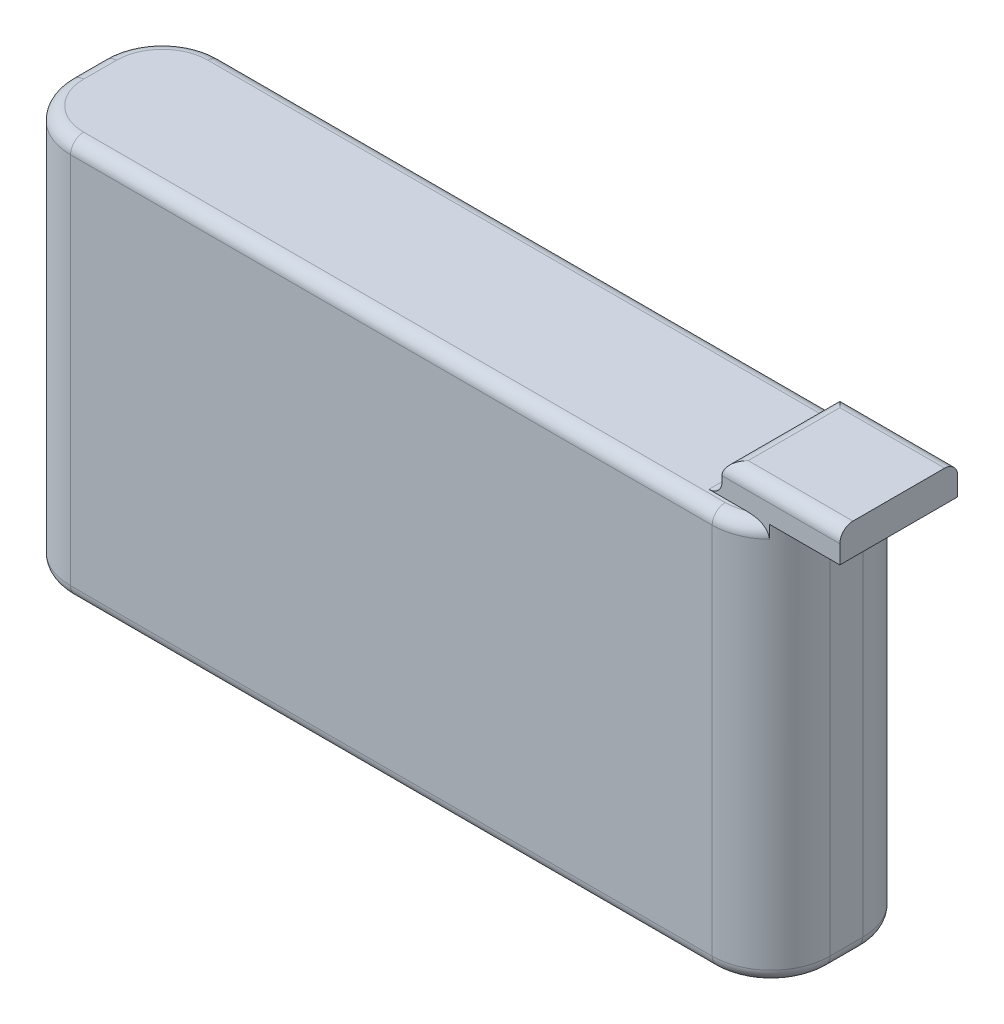
ISO-10303-21;
HEADER;
FILE_DESCRIPTION(('STEP AP214'),'2;1');
FILE_NAME('part.step','',(''),(''),'','','');
FILE_SCHEMA(('AUTOMOTIVE_DESIGN { 1 0 10303 214 1 1 1 1 }'));
ENDSEC;
DATA;
#1=APPLICATION_CONTEXT('core data for automotive mechanical design processes');
#2=APPLICATION_PROTOCOL_DEFINITION('international standard','automotive_design',2000,#1);
#3=PRODUCT_CONTEXT('',#1,'mechanical');
#4=PRODUCT('Part','Part','',(#3));
#5=PRODUCT_RELATED_PRODUCT_CATEGORY('part','',(#4));
#6=PRODUCT_DEFINITION_FORMATION('','',#4);
#7=PRODUCT_DEFINITION_CONTEXT('part definition',#1,'design');
#8=PRODUCT_DEFINITION('design','',#6,#7);
#9=PRODUCT_DEFINITION_SHAPE('','',#8);
#10=(LENGTH_UNIT() NAMED_UNIT(*) SI_UNIT(.MILLI.,.METRE.));
#11=(NAMED_UNIT(*) PLANE_ANGLE_UNIT() SI_UNIT($,.RADIAN.));
#12=(NAMED_UNIT(*) SI_UNIT($,.STERADIAN.) SOLID_ANGLE_UNIT());
#13=UNCERTAINTY_MEASURE_WITH_UNIT(LENGTH_MEASURE(1.E-05),#10,'distance_accuracy_value','');
#14=(GEOMETRIC_REPRESENTATION_CONTEXT(3) GLOBAL_UNCERTAINTY_ASSIGNED_CONTEXT((#13)) GLOBAL_UNIT_ASSIGNED_CONTEXT((#10,
#11,#12)) REPRESENTATION_CONTEXT('',''));
#15=CARTESIAN_POINT('',(0.,0.,0.));
#16=DIRECTION('',(0.,0.,1.));
#17=DIRECTION('',(1.,0.,0.));
#18=AXIS2_PLACEMENT_3D('',#15,#16,#17);
#19=CARTESIAN_POINT('',(0.,30.5,11.5));
#20=DIRECTION('',(0.,-1.,0.));
#21=DIRECTION('',(0.,0.,-1.));
#22=AXIS2_PLACEMENT_3D('',#19,#20,#21);
#23=PLANE('',#22);
#24=DIRECTION('',(1.,0.,0.));
#25=VECTOR('',#24,1.);
#26=CARTESIAN_POINT('',(53.,30.5,10.25));
#27=LINE('',#26,#25);
#28=CARTESIAN_POINT('',(52.,30.5,10.25));
#29=VERTEX_POINT('',#28);
#30=CARTESIAN_POINT('',(54.7990381056767,30.5,10.25));
#31=VERTEX_POINT('',#30);
#32=EDGE_CURVE('E223',#29,#31,#27,.T.);
#33=ORIENTED_EDGE('',*,*,#32,.F.);
#34=DIRECTION('',(0.,0.,1.));
#35=VECTOR('',#34,1.);
#36=CARTESIAN_POINT('',(52.,30.5,1.25));
#37=LINE('',#36,#35);
#38=CARTESIAN_POINT('',(52.,30.5,1.25));
#39=VERTEX_POINT('',#38);
#40=EDGE_CURVE('E335',#29,#39,#37,.F.);
#41=ORIENTED_EDGE('',*,*,#40,.T.);
#42=DIRECTION('',(-1.,0.,0.));
#43=VECTOR('',#42,1.);
#44=CARTESIAN_POINT('',(53.,30.5,1.25));
#45=LINE('',#44,#43);
#46=CARTESIAN_POINT('',(54.7990381056767,30.5,1.25));
#47=VERTEX_POINT('',#46);
#48=EDGE_CURVE('E233',#47,#39,#45,.T.);
#49=ORIENTED_EDGE('',*,*,#48,.F.);
#50=CARTESIAN_POINT('',(53.5,30.5,4.5));
#51=DIRECTION('',(0.,-1.,0.));
#52=DIRECTION('',(0.,0.,-1.));
#53=AXIS2_PLACEMENT_3D('',#50,#51,#52);
#54=CIRCLE('',#53,3.5);
#55=CARTESIAN_POINT('',(53.5,30.5,1.));
#56=VERTEX_POINT('',#55);
#57=EDGE_CURVE('E332',#47,#56,#54,.F.);
#58=ORIENTED_EDGE('',*,*,#57,.T.);
#59=DIRECTION('',(-1.,0.,0.));
#60=VECTOR('',#59,1.);
#61=CARTESIAN_POINT('',(4.5,30.5,1.));
#62=LINE('',#61,#60);
#63=CARTESIAN_POINT('',(4.5,30.5,1.));
#64=VERTEX_POINT('',#63);
#65=EDGE_CURVE('E320',#56,#64,#62,.T.);
#66=ORIENTED_EDGE('',*,*,#65,.T.);
#67=CARTESIAN_POINT('',(4.5,30.5,4.5));
#68=DIRECTION('',(0.,-1.,0.));
#69=DIRECTION('',(0.,0.,-1.));
#70=AXIS2_PLACEMENT_3D('',#67,#68,#69);
#71=CIRCLE('',#70,3.5);
#72=CARTESIAN_POINT('',(1.,30.5,4.5));
#73=VERTEX_POINT('',#72);
#74=EDGE_CURVE('E322',#64,#73,#71,.F.);
#75=ORIENTED_EDGE('',*,*,#74,.T.);
#76=DIRECTION('',(0.,0.,-1.));
#77=VECTOR('',#76,1.);
#78=CARTESIAN_POINT('',(1.,30.5,11.5));
#79=LINE('',#78,#77);
#80=CARTESIAN_POINT('',(1.,30.5,7.));
#81=VERTEX_POINT('',#80);
#82=EDGE_CURVE('E324',#73,#81,#79,.F.);
#83=ORIENTED_EDGE('',*,*,#82,.T.);
#84=CARTESIAN_POINT('',(4.5,30.5,7.));
#85=DIRECTION('',(0.,-1.,0.));
#86=DIRECTION('',(0.,0.,-1.));
#87=AXIS2_PLACEMENT_3D('',#84,#85,#86);
#88=CIRCLE('',#87,3.5);
#89=CARTESIAN_POINT('',(4.5,30.5,10.5));
#90=VERTEX_POINT('',#89);
#91=EDGE_CURVE('E326',#81,#90,#88,.F.);
#92=ORIENTED_EDGE('',*,*,#91,.T.);
#93=DIRECTION('',(-1.,0.,0.));
#94=VECTOR('',#93,1.);
#95=CARTESIAN_POINT('',(0.,30.5,10.5));
#96=LINE('',#95,#94);
#97=CARTESIAN_POINT('',(53.5,30.5,10.5));
#98=VERTEX_POINT('',#97);
#99=EDGE_CURVE('E328',#90,#98,#96,.F.);
#100=ORIENTED_EDGE('',*,*,#99,.T.);
#101=CARTESIAN_POINT('',(53.5,30.5,7.));
#102=DIRECTION('',(0.,-1.,0.));
#103=DIRECTION('',(0.,0.,-1.));
#104=AXIS2_PLACEMENT_3D('',#101,#102,#103);
#105=CIRCLE('',#104,3.5);
#106=EDGE_CURVE('E330',#98,#31,#105,.F.);
#107=ORIENTED_EDGE('',*,*,#106,.T.);
#108=EDGE_LOOP('',(#33,#41,#49,#58,#66,#75,#83,#92,#100,#107));
#109=FACE_BOUND('',#108,.T.);
#110=ADVANCED_FACE('F37',(#109),#23,.F.);
#111=CARTESIAN_POINT('',(0.,0.,11.5));
#112=DIRECTION('',(1.,0.,0.));
#113=DIRECTION('',(0.,0.,-1.));
#114=AXIS2_PLACEMENT_3D('',#111,#112,#113);
#115=PLANE('',#114);
#116=DIRECTION('',(0.,-1.,0.));
#117=VECTOR('',#116,1.);
#118=CARTESIAN_POINT('',(0.,0.,4.5));
#119=LINE('',#118,#117);
#120=CARTESIAN_POINT('',(0.,29.5,4.5));
#121=VERTEX_POINT('',#120);
#122=CARTESIAN_POINT('',(0.,1.,4.5));
#123=VERTEX_POINT('',#122);
#124=EDGE_CURVE('E248',#121,#123,#119,.T.);
#125=ORIENTED_EDGE('',*,*,#124,.T.);
#126=DIRECTION('',(0.,0.,-1.));
#127=VECTOR('',#126,1.);
#128=CARTESIAN_POINT('',(0.,1.,11.5));
#129=LINE('',#128,#127);
#130=CARTESIAN_POINT('',(0.,1.,7.));
#131=VERTEX_POINT('',#130);
#132=EDGE_CURVE('E296',#123,#131,#129,.F.);
#133=ORIENTED_EDGE('',*,*,#132,.T.);
#134=DIRECTION('',(0.,-1.,0.));
#135=VECTOR('',#134,1.);
#136=CARTESIAN_POINT('',(0.,0.,7.));
#137=LINE('',#136,#135);
#138=CARTESIAN_POINT('',(0.,29.5,7.));
#139=VERTEX_POINT('',#138);
#140=EDGE_CURVE('E245',#131,#139,#137,.F.);
#141=ORIENTED_EDGE('',*,*,#140,.T.);
#142=DIRECTION('',(0.,0.,-1.));
#143=VECTOR('',#142,1.);
#144=CARTESIAN_POINT('',(0.,29.5,11.5));
#145=LINE('',#144,#143);
#146=EDGE_CURVE('E294',#139,#121,#145,.T.);
#147=ORIENTED_EDGE('',*,*,#146,.T.);
#148=EDGE_LOOP('',(#125,#133,#141,#147));
#149=FACE_BOUND('',#148,.T.);
#150=ADVANCED_FACE('F426',(#149),#115,.F.);
#151=CARTESIAN_POINT('',(0.,0.,11.5));
#152=DIRECTION('',(0.,1.,0.));
#153=DIRECTION('',(0.,0.,1.));
#154=AXIS2_PLACEMENT_3D('',#151,#152,#153);
#155=PLANE('',#154);
#156=DIRECTION('',(0.,0.,-1.));
#157=VECTOR('',#156,1.);
#158=CARTESIAN_POINT('',(1.,0.,11.5));
#159=LINE('',#158,#157);
#160=CARTESIAN_POINT('',(1.,0.,7.));
#161=VERTEX_POINT('',#160);
#162=CARTESIAN_POINT('',(1.,0.,4.5));
#163=VERTEX_POINT('',#162);
#164=EDGE_CURVE('E284',#161,#163,#159,.T.);
#165=ORIENTED_EDGE('',*,*,#164,.T.);
#166=CARTESIAN_POINT('',(4.5,0.,4.5));
#167=DIRECTION('',(0.,1.,0.));
#168=DIRECTION('',(0.,0.,1.));
#169=AXIS2_PLACEMENT_3D('',#166,#167,#168);
#170=CIRCLE('',#169,3.5);
#171=CARTESIAN_POINT('',(4.5,0.,1.));
#172=VERTEX_POINT('',#171);
#173=EDGE_CURVE('E286',#163,#172,#170,.F.);
#174=ORIENTED_EDGE('',*,*,#173,.T.);
#175=DIRECTION('',(1.,0.,0.));
#176=VECTOR('',#175,1.);
#177=CARTESIAN_POINT('',(53.5,0.,1.));
#178=LINE('',#177,#176);
#179=CARTESIAN_POINT('',(53.5,0.,1.));
#180=VERTEX_POINT('',#179);
#181=EDGE_CURVE('E272',#172,#180,#178,.T.);
#182=ORIENTED_EDGE('',*,*,#181,.T.);
#183=CARTESIAN_POINT('',(53.5,0.,4.5));
#184=DIRECTION('',(0.,1.,0.));
#185=DIRECTION('',(0.,0.,1.));
#186=AXIS2_PLACEMENT_3D('',#183,#184,#185);
#187=CIRCLE('',#186,3.5);
#188=CARTESIAN_POINT('',(57.,0.,4.5));
#189=VERTEX_POINT('',#188);
#190=EDGE_CURVE('E274',#180,#189,#187,.F.);
#191=ORIENTED_EDGE('',*,*,#190,.T.);
#192=DIRECTION('',(0.,0.,-1.));
#193=VECTOR('',#192,1.);
#194=CARTESIAN_POINT('',(57.,0.,11.5));
#195=LINE('',#194,#193);
#196=CARTESIAN_POINT('',(57.,0.,7.));
#197=VERTEX_POINT('',#196);
#198=EDGE_CURVE('E276',#189,#197,#195,.F.);
#199=ORIENTED_EDGE('',*,*,#198,.T.);
#200=CARTESIAN_POINT('',(53.5,0.,7.));
#201=DIRECTION('',(0.,1.,0.));
#202=DIRECTION('',(0.,0.,1.));
#203=AXIS2_PLACEMENT_3D('',#200,#201,#202);
#204=CIRCLE('',#203,3.5);
#205=CARTESIAN_POINT('',(53.5,0.,10.5));
#206=VERTEX_POINT('',#205);
#207=EDGE_CURVE('E278',#197,#206,#204,.F.);
#208=ORIENTED_EDGE('',*,*,#207,.T.);
#209=DIRECTION('',(1.,0.,0.));
#210=VECTOR('',#209,1.);
#211=CARTESIAN_POINT('',(0.,0.,10.5));
#212=LINE('',#211,#210);
#213=CARTESIAN_POINT('',(4.5,0.,10.5));
#214=VERTEX_POINT('',#213);
#215=EDGE_CURVE('E280',#206,#214,#212,.F.);
#216=ORIENTED_EDGE('',*,*,#215,.T.);
#217=CARTESIAN_POINT('',(4.5,0.,7.));
#218=DIRECTION('',(0.,1.,0.));
#219=DIRECTION('',(0.,0.,1.));
#220=AXIS2_PLACEMENT_3D('',#217,#218,#219);
#221=CIRCLE('',#220,3.5);
#222=EDGE_CURVE('E282',#214,#161,#221,.F.);
#223=ORIENTED_EDGE('',*,*,#222,.T.);
#224=EDGE_LOOP('',(#165,#174,#182,#191,#199,#208,#216,#223));
#225=FACE_BOUND('',#224,.T.);
#226=ADVANCED_FACE('F432',(#225),#155,.F.);
#227=CARTESIAN_POINT('',(58.,0.,11.5));
#228=DIRECTION('',(-1.,0.,0.));
#229=DIRECTION('',(0.,0.,1.));
#230=AXIS2_PLACEMENT_3D('',#227,#228,#229);
#231=PLANE('',#230);
#232=DIRECTION('',(0.,1.,0.));
#233=VECTOR('',#232,1.);
#234=CARTESIAN_POINT('',(58.,0.,7.));
#235=LINE('',#234,#233);
#236=CARTESIAN_POINT('',(58.,30.5,7.));
#237=VERTEX_POINT('',#236);
#238=CARTESIAN_POINT('',(58.,1.,7.));
#239=VERTEX_POINT('',#238);
#240=EDGE_CURVE('E267',#237,#239,#235,.F.);
#241=ORIENTED_EDGE('',*,*,#240,.T.);
#242=DIRECTION('',(0.,0.,-1.));
#243=VECTOR('',#242,1.);
#244=CARTESIAN_POINT('',(58.,1.,11.5));
#245=LINE('',#244,#243);
#246=CARTESIAN_POINT('',(58.,1.,4.5));
#247=VERTEX_POINT('',#246);
#248=EDGE_CURVE('E311',#239,#247,#245,.T.);
#249=ORIENTED_EDGE('',*,*,#248,.T.);
#250=DIRECTION('',(0.,1.,0.));
#251=VECTOR('',#250,1.);
#252=CARTESIAN_POINT('',(58.,30.5,4.5));
#253=LINE('',#252,#251);
#254=CARTESIAN_POINT('',(58.,30.5,4.5));
#255=VERTEX_POINT('',#254);
#256=EDGE_CURVE('E270',#247,#255,#253,.T.);
#257=ORIENTED_EDGE('',*,*,#256,.T.);
#258=DIRECTION('',(0.,0.,-1.));
#259=VECTOR('',#258,1.);
#260=CARTESIAN_POINT('',(58.,30.5,11.5));
#261=LINE('',#260,#259);
#262=EDGE_CURVE('E242',#237,#255,#261,.T.);
#263=ORIENTED_EDGE('',*,*,#262,.F.);
#264=EDGE_LOOP('',(#241,#249,#257,#263));
#265=FACE_BOUND('',#264,.T.);
#266=ADVANCED_FACE('F439',(#265),#231,.F.);
#267=CARTESIAN_POINT('',(0.,0.,11.5));
#268=DIRECTION('',(0.,0.,-1.));
#269=DIRECTION('',(-1.,0.,0.));
#270=AXIS2_PLACEMENT_3D('',#267,#268,#269);
#271=PLANE('',#270);
#272=DIRECTION('',(0.,-1.,0.));
#273=VECTOR('',#272,1.);
#274=CARTESIAN_POINT('',(4.5,0.,11.5));
#275=LINE('',#274,#273);
#276=CARTESIAN_POINT('',(4.5,29.5,11.5));
#277=VERTEX_POINT('',#276);
#278=CARTESIAN_POINT('',(4.5,1.,11.5));
#279=VERTEX_POINT('',#278);
#280=EDGE_CURVE('E264',#277,#279,#275,.T.);
#281=ORIENTED_EDGE('',*,*,#280,.T.);
#282=DIRECTION('',(1.,0.,0.));
#283=VECTOR('',#282,1.);
#284=CARTESIAN_POINT('',(0.,1.,11.5));
#285=LINE('',#284,#283);
#286=CARTESIAN_POINT('',(53.5,1.,11.5));
#287=VERTEX_POINT('',#286);
#288=EDGE_CURVE('E304',#279,#287,#285,.T.);
#289=ORIENTED_EDGE('',*,*,#288,.T.);
#290=DIRECTION('',(0.,1.,0.));
#291=VECTOR('',#290,1.);
#292=CARTESIAN_POINT('',(53.5,0.,11.5));
#293=LINE('',#292,#291);
#294=CARTESIAN_POINT('',(53.5,29.5,11.5));
#295=VERTEX_POINT('',#294);
#296=EDGE_CURVE('E261',#287,#295,#293,.T.);
#297=ORIENTED_EDGE('',*,*,#296,.T.);
#298=DIRECTION('',(-1.,0.,0.));
#299=VECTOR('',#298,1.);
#300=CARTESIAN_POINT('',(0.,29.5,11.5));
#301=LINE('',#300,#299);
#302=EDGE_CURVE('E302',#295,#277,#301,.T.);
#303=ORIENTED_EDGE('',*,*,#302,.T.);
#304=EDGE_LOOP('',(#281,#289,#297,#303));
#305=FACE_BOUND('',#304,.T.);
#306=ADVANCED_FACE('F442',(#305),#271,.F.);
#307=CARTESIAN_POINT('',(0.,0.,0.));
#308=DIRECTION('',(0.,0.,-1.));
#309=DIRECTION('',(-1.,0.,0.));
#310=AXIS2_PLACEMENT_3D('',#307,#308,#309);
#311=PLANE('',#310);
#312=DIRECTION('',(0.,1.,0.));
#313=VECTOR('',#312,1.);
#314=CARTESIAN_POINT('',(53.5,0.,0.));
#315=LINE('',#314,#313);
#316=CARTESIAN_POINT('',(53.5,29.5,0.));
#317=VERTEX_POINT('',#316);
#318=CARTESIAN_POINT('',(53.5,1.,0.));
#319=VERTEX_POINT('',#318);
#320=EDGE_CURVE('E251',#317,#319,#315,.F.);
#321=ORIENTED_EDGE('',*,*,#320,.T.);
#322=DIRECTION('',(1.,0.,0.));
#323=VECTOR('',#322,1.);
#324=CARTESIAN_POINT('',(4.5,1.,0.));
#325=LINE('',#324,#323);
#326=CARTESIAN_POINT('',(4.5,1.,0.));
#327=VERTEX_POINT('',#326);
#328=EDGE_CURVE('E340',#319,#327,#325,.F.);
#329=ORIENTED_EDGE('',*,*,#328,.T.);
#330=DIRECTION('',(0.,-1.,0.));
#331=VECTOR('',#330,1.);
#332=CARTESIAN_POINT('',(4.5,30.5,0.));
#333=LINE('',#332,#331);
#334=CARTESIAN_POINT('',(4.5,29.5,0.));
#335=VERTEX_POINT('',#334);
#336=EDGE_CURVE('E254',#327,#335,#333,.F.);
#337=ORIENTED_EDGE('',*,*,#336,.T.);
#338=DIRECTION('',(-1.,0.,0.));
#339=VECTOR('',#338,1.);
#340=CARTESIAN_POINT('',(53.5,29.5,0.));
#341=LINE('',#340,#339);
#342=EDGE_CURVE('E338',#335,#317,#341,.F.);
#343=ORIENTED_EDGE('',*,*,#342,.T.);
#344=EDGE_LOOP('',(#321,#329,#337,#343));
#345=FACE_BOUND('',#344,.T.);
#346=ADVANCED_FACE('F437',(#345),#311,.T.);
#347=CARTESIAN_POINT('',(4.5,0.,4.5));
#348=DIRECTION('',(0.,1.,0.));
#349=DIRECTION('',(0.,0.,1.));
#350=AXIS2_PLACEMENT_3D('',#347,#348,#349);
#351=CYLINDRICAL_SURFACE('',#350,4.5);
#352=ORIENTED_EDGE('',*,*,#336,.F.);
#353=CARTESIAN_POINT('',(4.5,1.,4.5));
#354=DIRECTION('',(0.,1.,0.));
#355=DIRECTION('',(0.,0.,1.));
#356=AXIS2_PLACEMENT_3D('',#353,#354,#355);
#357=CIRCLE('',#356,4.5);
#358=EDGE_CURVE('E291',#327,#123,#357,.T.);
#359=ORIENTED_EDGE('',*,*,#358,.T.);
#360=ORIENTED_EDGE('',*,*,#124,.F.);
#361=CARTESIAN_POINT('',(4.5,29.5,4.5));
#362=DIRECTION('',(0.,-1.,0.));
#363=DIRECTION('',(0.,0.,-1.));
#364=AXIS2_PLACEMENT_3D('',#361,#362,#363);
#365=CIRCLE('',#364,4.5);
#366=EDGE_CURVE('E289',#121,#335,#365,.T.);
#367=ORIENTED_EDGE('',*,*,#366,.T.);
#368=EDGE_LOOP('',(#352,#359,#360,#367));
#369=FACE_BOUND('',#368,.T.);
#370=ADVANCED_FACE('F447',(#369),#351,.T.);
#371=CARTESIAN_POINT('',(4.5,0.,7.));
#372=DIRECTION('',(0.,-1.,0.));
#373=DIRECTION('',(0.,0.,-1.));
#374=AXIS2_PLACEMENT_3D('',#371,#372,#373);
#375=CYLINDRICAL_SURFACE('',#374,4.5);
#376=ORIENTED_EDGE('',*,*,#140,.F.);
#377=CARTESIAN_POINT('',(4.5,1.,7.));
#378=DIRECTION('',(0.,1.,0.));
#379=DIRECTION('',(0.,0.,1.));
#380=AXIS2_PLACEMENT_3D('',#377,#378,#379);
#381=CIRCLE('',#380,4.5);
#382=EDGE_CURVE('E300',#131,#279,#381,.T.);
#383=ORIENTED_EDGE('',*,*,#382,.T.);
#384=ORIENTED_EDGE('',*,*,#280,.F.);
#385=CARTESIAN_POINT('',(4.5,29.5,7.));
#386=DIRECTION('',(0.,-1.,0.));
#387=DIRECTION('',(0.,0.,-1.));
#388=AXIS2_PLACEMENT_3D('',#385,#386,#387);
#389=CIRCLE('',#388,4.5);
#390=EDGE_CURVE('E298',#277,#139,#389,.T.);
#391=ORIENTED_EDGE('',*,*,#390,.T.);
#392=EDGE_LOOP('',(#376,#383,#384,#391));
#393=FACE_BOUND('',#392,.T.);
#394=ADVANCED_FACE('F450',(#393),#375,.T.);
#395=CARTESIAN_POINT('',(53.5,0.,4.5));
#396=DIRECTION('',(0.,-1.,0.));
#397=DIRECTION('',(0.,0.,-1.));
#398=AXIS2_PLACEMENT_3D('',#395,#396,#397);
#399=CYLINDRICAL_SURFACE('',#398,4.5);
#400=ORIENTED_EDGE('',*,*,#256,.F.);
#401=CARTESIAN_POINT('',(53.5,1.,4.5));
#402=DIRECTION('',(0.,1.,0.));
#403=DIRECTION('',(0.,0.,1.));
#404=AXIS2_PLACEMENT_3D('',#401,#402,#403);
#405=CIRCLE('',#404,4.5);
#406=EDGE_CURVE('E318',#247,#319,#405,.T.);
#407=ORIENTED_EDGE('',*,*,#406,.T.);
#408=ORIENTED_EDGE('',*,*,#320,.F.);
#409=CARTESIAN_POINT('',(53.5,29.5,4.5));
#410=DIRECTION('',(0.,-1.,0.));
#411=DIRECTION('',(0.,0.,-1.));
#412=AXIS2_PLACEMENT_3D('',#409,#410,#411);
#413=CIRCLE('',#412,4.5);
#414=CARTESIAN_POINT('',(56.6124748994972,29.5,1.25));
#415=VERTEX_POINT('',#414);
#416=EDGE_CURVE('E315',#317,#415,#413,.T.);
#417=ORIENTED_EDGE('',*,*,#416,.T.);
#418=DIRECTION('',(0.,-1.,0.));
#419=VECTOR('',#418,1.);
#420=CARTESIAN_POINT('',(56.6124748994972,29.5,1.25));
#421=LINE('',#420,#419);
#422=CARTESIAN_POINT('',(56.6124748994972,30.5,1.25));
#423=VERTEX_POINT('',#422);
#424=EDGE_CURVE('E313',#415,#423,#421,.F.);
#425=ORIENTED_EDGE('',*,*,#424,.T.);
#426=CARTESIAN_POINT('',(53.5,30.5,4.5));
#427=DIRECTION('',(0.,-1.,0.));
#428=DIRECTION('',(0.,0.,-1.));
#429=AXIS2_PLACEMENT_3D('',#426,#427,#428);
#430=CIRCLE('',#429,4.5);
#431=EDGE_CURVE('E259',#255,#423,#430,.F.);
#432=ORIENTED_EDGE('',*,*,#431,.F.);
#433=EDGE_LOOP('',(#400,#407,#408,#417,#425,#432));
#434=FACE_BOUND('',#433,.T.);
#435=ADVANCED_FACE('F454',(#434),#399,.T.);
#436=CARTESIAN_POINT('',(53.5,0.,7.));
#437=DIRECTION('',(0.,1.,0.));
#438=DIRECTION('',(0.,0.,1.));
#439=AXIS2_PLACEMENT_3D('',#436,#437,#438);
#440=CYLINDRICAL_SURFACE('',#439,4.5);
#441=ORIENTED_EDGE('',*,*,#296,.F.);
#442=CARTESIAN_POINT('',(53.5,1.,7.));
#443=DIRECTION('',(0.,1.,0.));
#444=DIRECTION('',(0.,0.,1.));
#445=AXIS2_PLACEMENT_3D('',#442,#443,#444);
#446=CIRCLE('',#445,4.5);
#447=EDGE_CURVE('E309',#287,#239,#446,.T.);
#448=ORIENTED_EDGE('',*,*,#447,.T.);
#449=ORIENTED_EDGE('',*,*,#240,.F.);
#450=CARTESIAN_POINT('',(53.5,30.5,7.));
#451=DIRECTION('',(0.,-1.,0.));
#452=DIRECTION('',(0.,0.,-1.));
#453=AXIS2_PLACEMENT_3D('',#450,#451,#452);
#454=CIRCLE('',#453,4.5);
#455=CARTESIAN_POINT('',(56.6124748994972,30.5,10.25));
#456=VERTEX_POINT('',#455);
#457=EDGE_CURVE('E257',#456,#237,#454,.F.);
#458=ORIENTED_EDGE('',*,*,#457,.F.);
#459=DIRECTION('',(0.,1.,0.));
#460=VECTOR('',#459,1.);
#461=CARTESIAN_POINT('',(56.6124748994972,30.5,10.25));
#462=LINE('',#461,#460);
#463=CARTESIAN_POINT('',(56.6124748994972,29.5,10.25));
#464=VERTEX_POINT('',#463);
#465=EDGE_CURVE('E54',#456,#464,#462,.F.);
#466=ORIENTED_EDGE('',*,*,#465,.T.);
#467=CARTESIAN_POINT('',(53.5,29.5,7.));
#468=DIRECTION('',(0.,-1.,0.));
#469=DIRECTION('',(0.,0.,-1.));
#470=AXIS2_PLACEMENT_3D('',#467,#468,#469);
#471=CIRCLE('',#470,4.5);
#472=EDGE_CURVE('E306',#464,#295,#471,.T.);
#473=ORIENTED_EDGE('',*,*,#472,.T.);
#474=EDGE_LOOP('',(#441,#448,#449,#458,#466,#473));
#475=FACE_BOUND('',#474,.T.);
#476=ADVANCED_FACE('F458',(#475),#440,.T.);
#477=CARTESIAN_POINT('',(53.,32.9,10.25));
#478=DIRECTION('',(1.,0.,0.));
#479=DIRECTION('',(0.,0.,-1.));
#480=AXIS2_PLACEMENT_3D('',#477,#478,#479);
#481=PLANE('',#480);
#482=DIRECTION('',(0.,-1.,0.));
#483=VECTOR('',#482,1.);
#484=CARTESIAN_POINT('',(53.,32.9,10.25));
#485=LINE('',#484,#483);
#486=CARTESIAN_POINT('',(53.,31.9,10.25));
#487=VERTEX_POINT('',#486);
#488=CARTESIAN_POINT('',(53.,31.5,10.25));
#489=VERTEX_POINT('',#488);
#490=EDGE_CURVE('E215',#487,#489,#485,.T.);
#491=ORIENTED_EDGE('',*,*,#490,.F.);
#492=DIRECTION('',(0.,0.,1.));
#493=VECTOR('',#492,1.);
#494=CARTESIAN_POINT('',(53.,31.9,10.25));
#495=LINE('',#494,#493);
#496=CARTESIAN_POINT('',(53.,31.9,1.25));
#497=VERTEX_POINT('',#496);
#498=EDGE_CURVE('E359',#487,#497,#495,.F.);
#499=ORIENTED_EDGE('',*,*,#498,.T.);
#500=DIRECTION('',(0.,-1.,0.));
#501=VECTOR('',#500,1.);
#502=CARTESIAN_POINT('',(53.,32.9,1.25));
#503=LINE('',#502,#501);
#504=CARTESIAN_POINT('',(53.,31.5,1.25));
#505=VERTEX_POINT('',#504);
#506=EDGE_CURVE('E237',#497,#505,#503,.T.);
#507=ORIENTED_EDGE('',*,*,#506,.T.);
#508=DIRECTION('',(0.,0.,1.));
#509=VECTOR('',#508,1.);
#510=CARTESIAN_POINT('',(53.,31.5,10.25));
#511=LINE('',#510,#509);
#512=EDGE_CURVE('E356',#505,#489,#511,.T.);
#513=ORIENTED_EDGE('',*,*,#512,.T.);
#514=EDGE_LOOP('',(#491,#499,#507,#513));
#515=FACE_BOUND('',#514,.T.);
#516=ADVANCED_FACE('F462',(#515),#481,.F.);
#517=CARTESIAN_POINT('',(53.,32.9,10.25));
#518=DIRECTION('',(0.,0.,-1.));
#519=DIRECTION('',(-1.,0.,0.));
#520=AXIS2_PLACEMENT_3D('',#517,#518,#519);
#521=PLANE('',#520);
#522=DIRECTION('',(0.,-1.,0.));
#523=VECTOR('',#522,1.);
#524=CARTESIAN_POINT('',(62.,32.9,10.25));
#525=LINE('',#524,#523);
#526=CARTESIAN_POINT('',(62.,31.9,10.25));
#527=VERTEX_POINT('',#526);
#528=CARTESIAN_POINT('',(62.,30.5,10.25));
#529=VERTEX_POINT('',#528);
#530=EDGE_CURVE('E206',#527,#529,#525,.T.);
#531=ORIENTED_EDGE('',*,*,#530,.F.);
#532=DIRECTION('',(1.,0.,0.));
#533=VECTOR('',#532,1.);
#534=CARTESIAN_POINT('',(53.,31.9,10.25));
#535=LINE('',#534,#533);
#536=EDGE_CURVE('E352',#527,#487,#535,.F.);
#537=ORIENTED_EDGE('',*,*,#536,.T.);
#538=ORIENTED_EDGE('',*,*,#490,.T.);
#539=CARTESIAN_POINT('',(52.,31.5,10.25));
#540=DIRECTION('',(0.,0.,-1.));
#541=DIRECTION('',(-1.,0.,0.));
#542=AXIS2_PLACEMENT_3D('',#539,#540,#541);
#543=CIRCLE('',#542,1.);
#544=EDGE_CURVE('E46',#489,#29,#543,.T.);
#545=ORIENTED_EDGE('',*,*,#544,.T.);
#546=ORIENTED_EDGE('',*,*,#32,.T.);
#547=CARTESIAN_POINT('',(54.7990381056767,30.5,10.25));
#548=CARTESIAN_POINT('',(54.8822227670898,30.4999703780612,10.25));
#549=CARTESIAN_POINT('',(54.9654977098744,30.4985667981553,10.25));
#550=CARTESIAN_POINT('',(55.1324017088077,30.4913593709148,10.25));
#551=CARTESIAN_POINT('',(55.2160293987426,30.4855261015676,10.25));
#552=CARTESIAN_POINT('',(55.3840562069119,30.4676173800699,10.25));
#553=CARTESIAN_POINT('',(55.4684454292603,30.4554409570347,10.25));
#554=CARTESIAN_POINT('',(55.6354460470621,30.4228178569805,10.25));
#555=CARTESIAN_POINT('',(55.7180620156239,30.4023960946076,10.25));
#556=CARTESIAN_POINT('',(55.8569209928903,30.358401022491,10.25));
#557=CARTESIAN_POINT('',(55.9139659680465,30.3373874052954,10.25));
#558=CARTESIAN_POINT('',(56.0252977894736,30.2891904302945,10.25));
#559=CARTESIAN_POINT('',(56.0795903192985,30.2620204775917,10.25));
#560=CARTESIAN_POINT('',(56.1846353279086,30.200373058163,10.25));
#561=CARTESIAN_POINT('',(56.2353485933693,30.1658276100103,10.25));
#562=CARTESIAN_POINT('',(56.3305698680231,30.0889396632437,10.25));
#563=CARTESIAN_POINT('',(56.375083734629,30.0466046135441,10.25));
#564=CARTESIAN_POINT('',(56.4447674439593,29.9660936121999,10.25));
#565=CARTESIAN_POINT('',(56.4719620488039,29.9296770022074,10.25));
#566=CARTESIAN_POINT('',(56.5200717722741,29.8529811062959,10.25));
#567=CARTESIAN_POINT('',(56.5410017358725,29.8127112551589,10.25));
#568=CARTESIAN_POINT('',(56.5756888869932,29.7282042220768,10.25));
#569=CARTESIAN_POINT('',(56.5893003570635,29.6839056261588,10.25));
#570=CARTESIAN_POINT('',(56.6031080088547,29.6159391840675,10.25));
#571=CARTESIAN_POINT('',(56.6066096242897,29.5929065774075,10.25));
#572=CARTESIAN_POINT('',(56.6112961673588,29.5465881842031,10.25));
#573=CARTESIAN_POINT('',(56.6124791811702,29.5233022044458,10.25));
#574=CARTESIAN_POINT('',(56.6124748994972,29.5,10.25));
#575=B_SPLINE_CURVE_WITH_KNOTS('',3,(#547,#548,#549,#550,#551,#552,#553,#554,#555,#556,#557,
#558,#559,#560,#561,#562,#563,#564,#565,#566,#567,#568,#569,#570,#571,#572,#573,#574),
.UNSPECIFIED.,.F.,.F.,(4,2,2,2,2,2,2,2,2,2,2,2,2,4),(0.,0.24968351035791,0.501040084155954,
0.756525884907898,1.01124540291139,1.19332262005154,1.3750071198137,1.55844471563892,
1.74170779987181,1.87754009625855,2.01304792267256,2.1511623326054,2.22095058754276,
2.29079642295712),.UNSPECIFIED.);
#576=EDGE_CURVE('E368',#31,#464,#575,.T.);
#577=ORIENTED_EDGE('',*,*,#576,.T.);
#578=ORIENTED_EDGE('',*,*,#465,.F.);
#579=EDGE_CURVE('E219',#456,#529,#27,.T.);
#580=ORIENTED_EDGE('',*,*,#579,.T.);
#581=EDGE_LOOP('',(#531,#537,#538,#545,#546,#577,#578,#580));
#582=FACE_BOUND('',#581,.T.);
#583=ADVANCED_FACE('F220',(#582),#521,.F.);
#584=CARTESIAN_POINT('',(62.,32.9,10.25));
#585=DIRECTION('',(-1.,0.,0.));
#586=DIRECTION('',(0.,0.,1.));
#587=AXIS2_PLACEMENT_3D('',#584,#585,#586);
#588=PLANE('',#587);
#589=DIRECTION('',(0.,0.,-1.));
#590=VECTOR('',#589,1.);
#591=CARTESIAN_POINT('',(62.,32.9,10.25));
#592=LINE('',#591,#590);
#593=CARTESIAN_POINT('',(62.,32.9,9.25));
#594=VERTEX_POINT('',#593);
#595=CARTESIAN_POINT('',(62.,32.9,2.25));
#596=VERTEX_POINT('',#595);
#597=EDGE_CURVE('E231',#594,#596,#592,.T.);
#598=ORIENTED_EDGE('',*,*,#597,.F.);
#599=CARTESIAN_POINT('',(62.,31.9,9.25));
#600=DIRECTION('',(-1.,0.,0.));
#601=DIRECTION('',(0.,0.,1.));
#602=AXIS2_PLACEMENT_3D('',#599,#600,#601);
#603=CIRCLE('',#602,1.);
#604=EDGE_CURVE('E213',#594,#527,#603,.F.);
#605=ORIENTED_EDGE('',*,*,#604,.T.);
#606=ORIENTED_EDGE('',*,*,#530,.T.);
#607=DIRECTION('',(0.,0.,-1.));
#608=VECTOR('',#607,1.);
#609=CARTESIAN_POINT('',(62.,30.5,10.25));
#610=LINE('',#609,#608);
#611=CARTESIAN_POINT('',(62.,30.5,1.25));
#612=VERTEX_POINT('',#611);
#613=EDGE_CURVE('E211',#529,#612,#610,.T.);
#614=ORIENTED_EDGE('',*,*,#613,.T.);
#615=DIRECTION('',(0.,-1.,0.));
#616=VECTOR('',#615,1.);
#617=CARTESIAN_POINT('',(62.,32.9,1.25));
#618=LINE('',#617,#616);
#619=CARTESIAN_POINT('',(62.,31.9,1.25));
#620=VERTEX_POINT('',#619);
#621=EDGE_CURVE('E216',#620,#612,#618,.T.);
#622=ORIENTED_EDGE('',*,*,#621,.F.);
#623=CARTESIAN_POINT('',(62.,31.9,2.25));
#624=DIRECTION('',(-1.,0.,0.));
#625=DIRECTION('',(0.,0.,1.));
#626=AXIS2_PLACEMENT_3D('',#623,#624,#625);
#627=CIRCLE('',#626,1.);
#628=EDGE_CURVE('E349',#620,#596,#627,.F.);
#629=ORIENTED_EDGE('',*,*,#628,.T.);
#630=EDGE_LOOP('',(#598,#605,#606,#614,#622,#629));
#631=FACE_BOUND('',#630,.T.);
#632=ADVANCED_FACE('F208',(#631),#588,.F.);
#633=CARTESIAN_POINT('',(53.,32.9,1.25));
#634=DIRECTION('',(0.,0.,1.));
#635=DIRECTION('',(1.,0.,0.));
#636=AXIS2_PLACEMENT_3D('',#633,#634,#635);
#637=PLANE('',#636);
#638=ORIENTED_EDGE('',*,*,#506,.F.);
#639=DIRECTION('',(-1.,0.,0.));
#640=VECTOR('',#639,1.);
#641=CARTESIAN_POINT('',(53.,31.9,1.25));
#642=LINE('',#641,#640);
#643=EDGE_CURVE('E354',#497,#620,#642,.F.);
#644=ORIENTED_EDGE('',*,*,#643,.T.);
#645=ORIENTED_EDGE('',*,*,#621,.T.);
#646=EDGE_CURVE('E229',#612,#423,#45,.T.);
#647=ORIENTED_EDGE('',*,*,#646,.T.);
#648=ORIENTED_EDGE('',*,*,#424,.F.);
#649=CARTESIAN_POINT('',(56.6124748994972,29.5,1.25));
#650=CARTESIAN_POINT('',(56.6124780786876,29.5216713645837,1.25));
#651=CARTESIAN_POINT('',(56.6114554931749,29.5433297928538,1.25));
#652=CARTESIAN_POINT('',(56.6073990936744,29.5864439080734,1.25));
#653=CARTESIAN_POINT('',(56.6043665630809,29.6078997155398,1.25));
#654=CARTESIAN_POINT('',(56.5923805743253,29.6713789490268,1.25));
#655=CARTESIAN_POINT('',(56.5805371470388,29.7128869295077,1.25));
#656=CARTESIAN_POINT('',(56.5499612772001,29.7931149539496,1.25));
#657=CARTESIAN_POINT('',(56.5312439694025,29.8318409010392,1.25));
#658=CARTESIAN_POINT('',(56.4879692417494,29.9059389152298,1.25));
#659=CARTESIAN_POINT('',(56.4634001160089,29.9413040584682,1.25));
#660=CARTESIAN_POINT('',(56.3998010731732,30.0203416837557,1.25));
#661=CARTESIAN_POINT('',(56.3587555264195,30.0623894241887,1.25));
#662=CARTESIAN_POINT('',(56.2704871956657,30.1392853414616,1.25));
#663=CARTESIAN_POINT('',(56.2232586778185,30.1741267570927,1.25));
#664=CARTESIAN_POINT('',(56.1011025867583,30.2520660269128,1.25));
#665=CARTESIAN_POINT('',(56.0236761612642,30.2912213185081,1.25));
#666=CARTESIAN_POINT('',(55.8634296621823,30.3574043620085,1.25));
#667=CARTESIAN_POINT('',(55.7805760626274,30.3843465812244,1.25));
#668=CARTESIAN_POINT('',(55.6225642691942,30.4256003657681,1.25));
#669=CARTESIAN_POINT('',(55.5476901718331,30.441046855782,1.25));
#670=CARTESIAN_POINT('',(55.3968385646794,30.4658085831165,1.25));
#671=CARTESIAN_POINT('',(55.320859368738,30.475113157353,1.25));
#672=CARTESIAN_POINT('',(55.1704719813004,30.4887823977633,1.25));
#673=CARTESIAN_POINT('',(55.0960738828931,30.4932684153085,1.25));
#674=CARTESIAN_POINT('',(54.9474456385715,30.4988611571914,1.25));
#675=CARTESIAN_POINT('',(54.8732160427156,30.4999815703169,1.25));
#676=CARTESIAN_POINT('',(54.7990381056767,30.5,1.25));
#677=B_SPLINE_CURVE_WITH_KNOTS('',3,(#649,#650,#651,#652,#653,#654,#655,#656,#657,#658,#659,
#660,#661,#662,#663,#664,#665,#666,#667,#668,#669,#670,#671,#672,#673,#674,#675,#676),
.UNSPECIFIED.,.F.,.F.,(4,2,2,2,2,2,2,2,2,2,2,2,2,4),(0.,0.0649652817161786,0.129889121576686,
0.258635810779999,0.387100711510491,0.515824782248132,0.69112916358665,0.866597282487761,
1.12543589590954,1.38606026041892,1.61510312322981,1.84454259265107,2.06805762380298,
2.2906623219352),.UNSPECIFIED.);
#678=EDGE_CURVE('E361',#415,#47,#677,.T.);
#679=ORIENTED_EDGE('',*,*,#678,.T.);
#680=ORIENTED_EDGE('',*,*,#48,.T.);
#681=CARTESIAN_POINT('',(52.,31.5,1.25));
#682=DIRECTION('',(0.,0.,1.));
#683=DIRECTION('',(1.,0.,0.));
#684=AXIS2_PLACEMENT_3D('',#681,#682,#683);
#685=CIRCLE('',#684,1.);
#686=EDGE_CURVE('E11',#39,#505,#685,.T.);
#687=ORIENTED_EDGE('',*,*,#686,.T.);
#688=EDGE_LOOP('',(#638,#644,#645,#647,#648,#679,#680,#687));
#689=FACE_BOUND('',#688,.T.);
#690=ADVANCED_FACE('F375',(#689),#637,.F.);
#691=CARTESIAN_POINT('',(0.,32.9,0.));
#692=DIRECTION('',(0.,-1.,0.));
#693=DIRECTION('',(0.,0.,-1.));
#694=AXIS2_PLACEMENT_3D('',#691,#692,#693);
#695=PLANE('',#694);
#696=DIRECTION('',(0.,0.,1.));
#697=VECTOR('',#696,1.);
#698=CARTESIAN_POINT('',(54.,32.9,0.));
#699=LINE('',#698,#697);
#700=CARTESIAN_POINT('',(54.,32.9,2.25));
#701=VERTEX_POINT('',#700);
#702=CARTESIAN_POINT('',(54.,32.9,9.25));
#703=VERTEX_POINT('',#702);
#704=EDGE_CURVE('E342',#701,#703,#699,.T.);
#705=ORIENTED_EDGE('',*,*,#704,.T.);
#706=DIRECTION('',(1.,0.,0.));
#707=VECTOR('',#706,1.);
#708=CARTESIAN_POINT('',(0.,32.9,9.25));
#709=LINE('',#708,#707);
#710=EDGE_CURVE('E346',#703,#594,#709,.T.);
#711=ORIENTED_EDGE('',*,*,#710,.T.);
#712=ORIENTED_EDGE('',*,*,#597,.T.);
#713=DIRECTION('',(-1.,0.,0.));
#714=VECTOR('',#713,1.);
#715=CARTESIAN_POINT('',(0.,32.9,2.25));
#716=LINE('',#715,#714);
#717=EDGE_CURVE('E344',#596,#701,#716,.T.);
#718=ORIENTED_EDGE('',*,*,#717,.T.);
#719=EDGE_LOOP('',(#705,#711,#712,#718));
#720=FACE_BOUND('',#719,.T.);
#721=ADVANCED_FACE('F537',(#720),#695,.F.);
#722=CARTESIAN_POINT('',(0.,30.5,0.));
#723=DIRECTION('',(0.,-1.,0.));
#724=DIRECTION('',(0.,0.,-1.));
#725=AXIS2_PLACEMENT_3D('',#722,#723,#724);
#726=PLANE('',#725);
#727=ORIENTED_EDGE('',*,*,#579,.F.);
#728=ORIENTED_EDGE('',*,*,#457,.T.);
#729=ORIENTED_EDGE('',*,*,#262,.T.);
#730=ORIENTED_EDGE('',*,*,#431,.T.);
#731=ORIENTED_EDGE('',*,*,#646,.F.);
#732=ORIENTED_EDGE('',*,*,#613,.F.);
#733=EDGE_LOOP('',(#727,#728,#729,#730,#731,#732));
#734=FACE_BOUND('',#733,.T.);
#735=ADVANCED_FACE('F226',(#734),#726,.T.);
#736=CARTESIAN_POINT('',(53.5,1.,7.));
#737=DIRECTION('',(0.,1.,0.));
#738=DIRECTION('',(0.,0.,1.));
#739=AXIS2_PLACEMENT_3D('',#736,#737,#738);
#740=TOROIDAL_SURFACE('',#739,3.5,1.);
#741=CARTESIAN_POINT('',(57.,1.,7.));
#742=DIRECTION('',(0.,0.,-1.));
#743=DIRECTION('',(-1.,0.,0.));
#744=AXIS2_PLACEMENT_3D('',#741,#742,#743);
#745=CIRCLE('',#744,1.);
#746=EDGE_CURVE('E501',#239,#197,#745,.T.);
#747=ORIENTED_EDGE('',*,*,#746,.F.);
#748=ORIENTED_EDGE('',*,*,#447,.F.);
#749=CARTESIAN_POINT('',(53.5,1.,10.5));
#750=DIRECTION('',(-1.,0.,0.));
#751=DIRECTION('',(0.,0.,1.));
#752=AXIS2_PLACEMENT_3D('',#749,#750,#751);
#753=CIRCLE('',#752,1.);
#754=EDGE_CURVE('E224',#206,#287,#753,.T.);
#755=ORIENTED_EDGE('',*,*,#754,.F.);
#756=ORIENTED_EDGE('',*,*,#207,.F.);
#757=EDGE_LOOP('',(#747,#748,#755,#756));
#758=FACE_BOUND('',#757,.T.);
#759=ADVANCED_FACE('F387',(#758),#740,.T.);
#760=CARTESIAN_POINT('',(0.,1.,10.5));
#761=DIRECTION('',(1.,0.,0.));
#762=DIRECTION('',(0.,0.,-1.));
#763=AXIS2_PLACEMENT_3D('',#760,#761,#762);
#764=CYLINDRICAL_SURFACE('',#763,1.);
#765=ORIENTED_EDGE('',*,*,#754,.T.);
#766=ORIENTED_EDGE('',*,*,#288,.F.);
#767=CARTESIAN_POINT('',(4.5,1.,10.5));
#768=DIRECTION('',(-1.,0.,0.));
#769=DIRECTION('',(0.,0.,1.));
#770=AXIS2_PLACEMENT_3D('',#767,#768,#769);
#771=CIRCLE('',#770,1.);
#772=EDGE_CURVE('E504',#214,#279,#771,.T.);
#773=ORIENTED_EDGE('',*,*,#772,.F.);
#774=ORIENTED_EDGE('',*,*,#215,.F.);
#775=EDGE_LOOP('',(#765,#766,#773,#774));
#776=FACE_BOUND('',#775,.T.);
#777=ADVANCED_FACE('F485',(#776),#764,.T.);
#778=CARTESIAN_POINT('',(57.,1.,11.5));
#779=DIRECTION('',(0.,0.,-1.));
#780=DIRECTION('',(-1.,0.,0.));
#781=AXIS2_PLACEMENT_3D('',#778,#779,#780);
#782=CYLINDRICAL_SURFACE('',#781,1.);
#783=ORIENTED_EDGE('',*,*,#746,.T.);
#784=ORIENTED_EDGE('',*,*,#198,.F.);
#785=CARTESIAN_POINT('',(57.,1.,4.5));
#786=DIRECTION('',(0.,0.,-1.));
#787=DIRECTION('',(-1.,0.,0.));
#788=AXIS2_PLACEMENT_3D('',#785,#786,#787);
#789=CIRCLE('',#788,1.);
#790=EDGE_CURVE('E554',#247,#189,#789,.T.);
#791=ORIENTED_EDGE('',*,*,#790,.F.);
#792=ORIENTED_EDGE('',*,*,#248,.F.);
#793=EDGE_LOOP('',(#783,#784,#791,#792));
#794=FACE_BOUND('',#793,.T.);
#795=ADVANCED_FACE('F482',(#794),#782,.T.);
#796=CARTESIAN_POINT('',(4.5,1.,7.));
#797=DIRECTION('',(0.,1.,0.));
#798=DIRECTION('',(0.,0.,1.));
#799=AXIS2_PLACEMENT_3D('',#796,#797,#798);
#800=TOROIDAL_SURFACE('',#799,3.5,1.);
#801=ORIENTED_EDGE('',*,*,#772,.T.);
#802=ORIENTED_EDGE('',*,*,#382,.F.);
#803=CARTESIAN_POINT('',(1.,1.,7.));
#804=DIRECTION('',(0.,0.,-1.));
#805=DIRECTION('',(-1.,0.,0.));
#806=AXIS2_PLACEMENT_3D('',#803,#804,#805);
#807=CIRCLE('',#806,1.);
#808=EDGE_CURVE('E551',#161,#131,#807,.T.);
#809=ORIENTED_EDGE('',*,*,#808,.F.);
#810=ORIENTED_EDGE('',*,*,#222,.F.);
#811=EDGE_LOOP('',(#801,#802,#809,#810));
#812=FACE_BOUND('',#811,.T.);
#813=ADVANCED_FACE('F478',(#812),#800,.T.);
#814=CARTESIAN_POINT('',(53.5,1.,4.5));
#815=DIRECTION('',(0.,1.,0.));
#816=DIRECTION('',(0.,0.,1.));
#817=AXIS2_PLACEMENT_3D('',#814,#815,#816);
#818=TOROIDAL_SURFACE('',#817,3.5,1.);
#819=ORIENTED_EDGE('',*,*,#790,.T.);
#820=ORIENTED_EDGE('',*,*,#190,.F.);
#821=CARTESIAN_POINT('',(53.5,1.,1.));
#822=DIRECTION('',(-1.,0.,0.));
#823=DIRECTION('',(0.,0.,1.));
#824=AXIS2_PLACEMENT_3D('',#821,#822,#823);
#825=CIRCLE('',#824,1.);
#826=EDGE_CURVE('E548',#319,#180,#825,.T.);
#827=ORIENTED_EDGE('',*,*,#826,.F.);
#828=ORIENTED_EDGE('',*,*,#406,.F.);
#829=EDGE_LOOP('',(#819,#820,#827,#828));
#830=FACE_BOUND('',#829,.T.);
#831=ADVANCED_FACE('F474',(#830),#818,.T.);
#832=CARTESIAN_POINT('',(1.,1.,11.5));
#833=DIRECTION('',(0.,0.,-1.));
#834=DIRECTION('',(-1.,0.,0.));
#835=AXIS2_PLACEMENT_3D('',#832,#833,#834);
#836=CYLINDRICAL_SURFACE('',#835,1.);
#837=ORIENTED_EDGE('',*,*,#808,.T.);
#838=ORIENTED_EDGE('',*,*,#132,.F.);
#839=CARTESIAN_POINT('',(1.,1.,4.5));
#840=DIRECTION('',(0.,0.,-1.));
#841=DIRECTION('',(-1.,0.,0.));
#842=AXIS2_PLACEMENT_3D('',#839,#840,#841);
#843=CIRCLE('',#842,1.);
#844=EDGE_CURVE('E546',#163,#123,#843,.T.);
#845=ORIENTED_EDGE('',*,*,#844,.F.);
#846=ORIENTED_EDGE('',*,*,#164,.F.);
#847=EDGE_LOOP('',(#837,#838,#845,#846));
#848=FACE_BOUND('',#847,.T.);
#849=ADVANCED_FACE('F470',(#848),#836,.T.);
#850=CARTESIAN_POINT('',(0.,1.,1.));
#851=DIRECTION('',(-1.,0.,0.));
#852=DIRECTION('',(0.,0.,1.));
#853=AXIS2_PLACEMENT_3D('',#850,#851,#852);
#854=CYLINDRICAL_SURFACE('',#853,1.);
#855=ORIENTED_EDGE('',*,*,#826,.T.);
#856=ORIENTED_EDGE('',*,*,#181,.F.);
#857=CARTESIAN_POINT('',(4.5,1.,1.));
#858=DIRECTION('',(-1.,0.,0.));
#859=DIRECTION('',(0.,0.,1.));
#860=AXIS2_PLACEMENT_3D('',#857,#858,#859);
#861=CIRCLE('',#860,1.);
#862=EDGE_CURVE('E524',#327,#172,#861,.T.);
#863=ORIENTED_EDGE('',*,*,#862,.F.);
#864=ORIENTED_EDGE('',*,*,#328,.F.);
#865=EDGE_LOOP('',(#855,#856,#863,#864));
#866=FACE_BOUND('',#865,.T.);
#867=ADVANCED_FACE('F466',(#866),#854,.T.);
#868=CARTESIAN_POINT('',(4.5,1.,4.5));
#869=DIRECTION('',(0.,1.,0.));
#870=DIRECTION('',(0.,0.,1.));
#871=AXIS2_PLACEMENT_3D('',#868,#869,#870);
#872=TOROIDAL_SURFACE('',#871,3.5,1.);
#873=ORIENTED_EDGE('',*,*,#844,.T.);
#874=ORIENTED_EDGE('',*,*,#358,.F.);
#875=ORIENTED_EDGE('',*,*,#862,.T.);
#876=ORIENTED_EDGE('',*,*,#173,.F.);
#877=EDGE_LOOP('',(#873,#874,#875,#876));
#878=FACE_BOUND('',#877,.T.);
#879=ADVANCED_FACE('F411',(#878),#872,.T.);
#880=CARTESIAN_POINT('',(53.5,29.5,7.));
#881=DIRECTION('',(0.,-1.,0.));
#882=DIRECTION('',(0.,0.,-1.));
#883=AXIS2_PLACEMENT_3D('',#880,#881,#882);
#884=TOROIDAL_SURFACE('',#883,3.5,1.);
#885=ORIENTED_EDGE('',*,*,#576,.F.);
#886=ORIENTED_EDGE('',*,*,#106,.F.);
#887=CARTESIAN_POINT('',(53.5,29.5,10.5));
#888=DIRECTION('',(-1.,0.,0.));
#889=DIRECTION('',(0.,0.,1.));
#890=AXIS2_PLACEMENT_3D('',#887,#888,#889);
#891=CIRCLE('',#890,1.);
#892=EDGE_CURVE('E522',#295,#98,#891,.T.);
#893=ORIENTED_EDGE('',*,*,#892,.F.);
#894=ORIENTED_EDGE('',*,*,#472,.F.);
#895=EDGE_LOOP('',(#885,#886,#893,#894));
#896=FACE_BOUND('',#895,.T.);
#897=ADVANCED_FACE('F406',(#896),#884,.T.);
#898=CARTESIAN_POINT('',(0.,29.5,10.5));
#899=DIRECTION('',(-1.,0.,0.));
#900=DIRECTION('',(0.,0.,1.));
#901=AXIS2_PLACEMENT_3D('',#898,#899,#900);
#902=CYLINDRICAL_SURFACE('',#901,1.);
#903=ORIENTED_EDGE('',*,*,#892,.T.);
#904=ORIENTED_EDGE('',*,*,#99,.F.);
#905=CARTESIAN_POINT('',(4.5,29.5,10.5));
#906=DIRECTION('',(-1.,0.,0.));
#907=DIRECTION('',(0.,0.,1.));
#908=AXIS2_PLACEMENT_3D('',#905,#906,#907);
#909=CIRCLE('',#908,1.);
#910=EDGE_CURVE('E519',#277,#90,#909,.T.);
#911=ORIENTED_EDGE('',*,*,#910,.F.);
#912=ORIENTED_EDGE('',*,*,#302,.F.);
#913=EDGE_LOOP('',(#903,#904,#911,#912));
#914=FACE_BOUND('',#913,.T.);
#915=ADVANCED_FACE('F403',(#914),#902,.T.);
#916=CARTESIAN_POINT('',(4.5,29.5,7.));
#917=DIRECTION('',(0.,-1.,0.));
#918=DIRECTION('',(0.,0.,-1.));
#919=AXIS2_PLACEMENT_3D('',#916,#917,#918);
#920=TOROIDAL_SURFACE('',#919,3.5,1.);
#921=ORIENTED_EDGE('',*,*,#910,.T.);
#922=ORIENTED_EDGE('',*,*,#91,.F.);
#923=CARTESIAN_POINT('',(1.,29.5,7.));
#924=DIRECTION('',(0.,0.,-1.));
#925=DIRECTION('',(-1.,0.,0.));
#926=AXIS2_PLACEMENT_3D('',#923,#924,#925);
#927=CIRCLE('',#926,1.);
#928=EDGE_CURVE('E516',#139,#81,#927,.T.);
#929=ORIENTED_EDGE('',*,*,#928,.F.);
#930=ORIENTED_EDGE('',*,*,#390,.F.);
#931=EDGE_LOOP('',(#921,#922,#929,#930));
#932=FACE_BOUND('',#931,.T.);
#933=ADVANCED_FACE('F399',(#932),#920,.T.);
#934=CARTESIAN_POINT('',(1.,29.5,11.5));
#935=DIRECTION('',(0.,0.,-1.));
#936=DIRECTION('',(-1.,0.,0.));
#937=AXIS2_PLACEMENT_3D('',#934,#935,#936);
#938=CYLINDRICAL_SURFACE('',#937,1.);
#939=ORIENTED_EDGE('',*,*,#928,.T.);
#940=ORIENTED_EDGE('',*,*,#82,.F.);
#941=CARTESIAN_POINT('',(1.,29.5,4.5));
#942=DIRECTION('',(0.,0.,-1.));
#943=DIRECTION('',(-1.,0.,0.));
#944=AXIS2_PLACEMENT_3D('',#941,#942,#943);
#945=CIRCLE('',#944,1.);
#946=EDGE_CURVE('E513',#121,#73,#945,.T.);
#947=ORIENTED_EDGE('',*,*,#946,.F.);
#948=ORIENTED_EDGE('',*,*,#146,.F.);
#949=EDGE_LOOP('',(#939,#940,#947,#948));
#950=FACE_BOUND('',#949,.T.);
#951=ADVANCED_FACE('F395',(#950),#938,.T.);
#952=CARTESIAN_POINT('',(4.5,29.5,4.5));
#953=DIRECTION('',(0.,-1.,0.));
#954=DIRECTION('',(0.,0.,-1.));
#955=AXIS2_PLACEMENT_3D('',#952,#953,#954);
#956=TOROIDAL_SURFACE('',#955,3.5,1.);
#957=ORIENTED_EDGE('',*,*,#946,.T.);
#958=ORIENTED_EDGE('',*,*,#74,.F.);
#959=CARTESIAN_POINT('',(4.5,29.5,1.));
#960=DIRECTION('',(1.,0.,0.));
#961=DIRECTION('',(0.,0.,-1.));
#962=AXIS2_PLACEMENT_3D('',#959,#960,#961);
#963=CIRCLE('',#962,1.);
#964=EDGE_CURVE('E510',#335,#64,#963,.T.);
#965=ORIENTED_EDGE('',*,*,#964,.F.);
#966=ORIENTED_EDGE('',*,*,#366,.F.);
#967=EDGE_LOOP('',(#957,#958,#965,#966));
#968=FACE_BOUND('',#967,.T.);
#969=ADVANCED_FACE('F391',(#968),#956,.T.);
#970=CARTESIAN_POINT('',(0.,29.5,1.));
#971=DIRECTION('',(1.,0.,0.));
#972=DIRECTION('',(0.,0.,-1.));
#973=AXIS2_PLACEMENT_3D('',#970,#971,#972);
#974=CYLINDRICAL_SURFACE('',#973,1.);
#975=ORIENTED_EDGE('',*,*,#964,.T.);
#976=ORIENTED_EDGE('',*,*,#65,.F.);
#977=CARTESIAN_POINT('',(53.5,29.5,1.));
#978=DIRECTION('',(1.,0.,0.));
#979=DIRECTION('',(0.,0.,-1.));
#980=AXIS2_PLACEMENT_3D('',#977,#978,#979);
#981=CIRCLE('',#980,1.);
#982=EDGE_CURVE('E508',#317,#56,#981,.T.);
#983=ORIENTED_EDGE('',*,*,#982,.F.);
#984=ORIENTED_EDGE('',*,*,#342,.F.);
#985=EDGE_LOOP('',(#975,#976,#983,#984));
#986=FACE_BOUND('',#985,.T.);
#987=ADVANCED_FACE('F385',(#986),#974,.T.);
#988=CARTESIAN_POINT('',(53.5,29.5,4.5));
#989=DIRECTION('',(0.,-1.,0.));
#990=DIRECTION('',(0.,0.,-1.));
#991=AXIS2_PLACEMENT_3D('',#988,#989,#990);
#992=TOROIDAL_SURFACE('',#991,3.5,1.);
#993=ORIENTED_EDGE('',*,*,#678,.F.);
#994=ORIENTED_EDGE('',*,*,#416,.F.);
#995=ORIENTED_EDGE('',*,*,#982,.T.);
#996=ORIENTED_EDGE('',*,*,#57,.F.);
#997=EDGE_LOOP('',(#993,#994,#995,#996));
#998=FACE_BOUND('',#997,.T.);
#999=ADVANCED_FACE('F379',(#998),#992,.T.);
#1000=CARTESIAN_POINT('',(0.,31.9,2.25));
#1001=DIRECTION('',(-1.,0.,0.));
#1002=DIRECTION('',(0.,0.,1.));
#1003=AXIS2_PLACEMENT_3D('',#1000,#1001,#1002);
#1004=CYLINDRICAL_SURFACE('',#1003,1.);
#1005=ORIENTED_EDGE('',*,*,#628,.F.);
#1006=ORIENTED_EDGE('',*,*,#643,.F.);
#1007=CARTESIAN_POINT('',(54.,31.9,2.25));
#1008=DIRECTION('',(-0.707106781186547,0.,0.707106781186547));
#1009=DIRECTION('',(0.707106781186547,0.,0.707106781186547));
#1010=AXIS2_PLACEMENT_3D('',#1007,#1008,#1009);
#1011=ELLIPSE('',#1010,1.41421356237309,1.);
#1012=EDGE_CURVE('E41',#701,#497,#1011,.T.);
#1013=ORIENTED_EDGE('',*,*,#1012,.F.);
#1014=ORIENTED_EDGE('',*,*,#717,.F.);
#1015=EDGE_LOOP('',(#1005,#1006,#1013,#1014));
#1016=FACE_BOUND('',#1015,.T.);
#1017=ADVANCED_FACE('F384',(#1016),#1004,.T.);
#1018=CARTESIAN_POINT('',(54.,31.9,0.));
#1019=DIRECTION('',(0.,0.,1.));
#1020=DIRECTION('',(1.,0.,0.));
#1021=AXIS2_PLACEMENT_3D('',#1018,#1019,#1020);
#1022=CYLINDRICAL_SURFACE('',#1021,1.);
#1023=ORIENTED_EDGE('',*,*,#1012,.T.);
#1024=ORIENTED_EDGE('',*,*,#498,.F.);
#1025=CARTESIAN_POINT('',(54.,31.9,9.25));
#1026=DIRECTION('',(0.707106781186547,0.,0.707106781186547));
#1027=DIRECTION('',(-0.707106781186547,0.,0.707106781186547));
#1028=AXIS2_PLACEMENT_3D('',#1025,#1026,#1027);
#1029=ELLIPSE('',#1028,1.41421356237309,1.);
#1030=EDGE_CURVE('E525',#703,#487,#1029,.T.);
#1031=ORIENTED_EDGE('',*,*,#1030,.F.);
#1032=ORIENTED_EDGE('',*,*,#704,.F.);
#1033=EDGE_LOOP('',(#1023,#1024,#1031,#1032));
#1034=FACE_BOUND('',#1033,.T.);
#1035=ADVANCED_FACE('F416',(#1034),#1022,.T.);
#1036=CARTESIAN_POINT('',(0.,31.9,9.25));
#1037=DIRECTION('',(1.,0.,0.));
#1038=DIRECTION('',(0.,0.,-1.));
#1039=AXIS2_PLACEMENT_3D('',#1036,#1037,#1038);
#1040=CYLINDRICAL_SURFACE('',#1039,1.);
#1041=ORIENTED_EDGE('',*,*,#1030,.T.);
#1042=ORIENTED_EDGE('',*,*,#536,.F.);
#1043=ORIENTED_EDGE('',*,*,#604,.F.);
#1044=ORIENTED_EDGE('',*,*,#710,.F.);
#1045=EDGE_LOOP('',(#1041,#1042,#1043,#1044));
#1046=FACE_BOUND('',#1045,.T.);
#1047=ADVANCED_FACE('F413',(#1046),#1040,.T.);
#1048=CARTESIAN_POINT('',(52.,31.5,10.25));
#1049=DIRECTION('',(0.,0.,-1.));
#1050=DIRECTION('',(-1.,0.,0.));
#1051=AXIS2_PLACEMENT_3D('',#1048,#1049,#1050);
#1052=CYLINDRICAL_SURFACE('',#1051,1.);
#1053=ORIENTED_EDGE('',*,*,#686,.F.);
#1054=ORIENTED_EDGE('',*,*,#40,.F.);
#1055=ORIENTED_EDGE('',*,*,#544,.F.);
#1056=ORIENTED_EDGE('',*,*,#512,.F.);
#1057=EDGE_LOOP('',(#1053,#1054,#1055,#1056));
#1058=FACE_BOUND('',#1057,.T.);
#1059=ADVANCED_FACE('F39',(#1058),#1052,.F.);
#1060=CLOSED_SHELL('',(#110,#150,#226,#266,#306,#346,#370,#394,#435,#476,#516,#583,#632,#690,
#721,#735,#759,#777,#795,#813,#831,#849,#867,#879,#897,#915,#933,#951,#969,#987,#999,#1017,
#1035,#1047,#1059));
#1061=MANIFOLD_SOLID_BREP('B2',#1060);
#1062=ADVANCED_BREP_SHAPE_REPRESENTATION('',(#18,#1061),#14);
#1063=SHAPE_DEFINITION_REPRESENTATION(#9,#1062);
ENDSEC;
END-ISO-10303-21;
